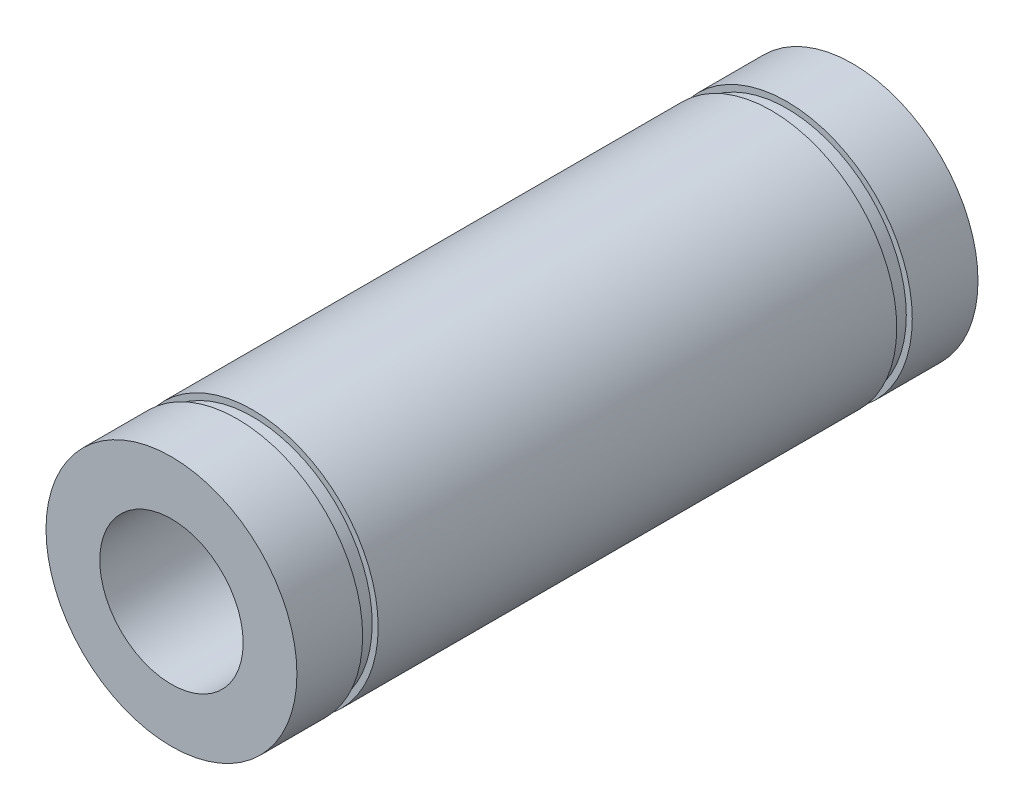
ISO-10303-21;
HEADER;
FILE_DESCRIPTION(('STEP AP214'),'2;1');
FILE_NAME('part.step','',(''),(''),'','','');
FILE_SCHEMA(('AUTOMOTIVE_DESIGN { 1 0 10303 214 1 1 1 1 }'));
ENDSEC;
DATA;
#1=APPLICATION_CONTEXT('core data for automotive mechanical design processes');
#2=APPLICATION_PROTOCOL_DEFINITION('international standard','automotive_design',2000,#1);
#3=PRODUCT_CONTEXT('',#1,'mechanical');
#4=PRODUCT('Part','Part','',(#3));
#5=PRODUCT_RELATED_PRODUCT_CATEGORY('part','',(#4));
#6=PRODUCT_DEFINITION_FORMATION('','',#4);
#7=PRODUCT_DEFINITION_CONTEXT('part definition',#1,'design');
#8=PRODUCT_DEFINITION('design','',#6,#7);
#9=PRODUCT_DEFINITION_SHAPE('','',#8);
#10=(LENGTH_UNIT() NAMED_UNIT(*) SI_UNIT(.MILLI.,.METRE.));
#11=(NAMED_UNIT(*) PLANE_ANGLE_UNIT() SI_UNIT($,.RADIAN.));
#12=(NAMED_UNIT(*) SI_UNIT($,.STERADIAN.) SOLID_ANGLE_UNIT());
#13=UNCERTAINTY_MEASURE_WITH_UNIT(LENGTH_MEASURE(1.E-05),#10,'distance_accuracy_value','');
#14=(GEOMETRIC_REPRESENTATION_CONTEXT(3) GLOBAL_UNCERTAINTY_ASSIGNED_CONTEXT((#13)) GLOBAL_UNIT_ASSIGNED_CONTEXT((#10,
#11,#12)) REPRESENTATION_CONTEXT('',''));
#15=CARTESIAN_POINT('',(0.,0.,0.));
#16=DIRECTION('',(0.,0.,1.));
#17=DIRECTION('',(1.,0.,0.));
#18=AXIS2_PLACEMENT_3D('',#15,#16,#17);
#19=CARTESIAN_POINT('',(0.,0.,0.));
#20=DIRECTION('',(0.,0.,1.));
#21=DIRECTION('',(1.,0.,0.));
#22=AXIS2_PLACEMENT_3D('',#19,#20,#21);
#23=CYLINDRICAL_SURFACE('',#22,10.5);
#24=CARTESIAN_POINT('',(0.,0.,-22.));
#25=DIRECTION('',(0.,0.,1.));
#26=DIRECTION('',(1.,0.,0.));
#27=AXIS2_PLACEMENT_3D('',#24,#25,#26);
#28=CIRCLE('',#27,10.5);
#29=CARTESIAN_POINT('',(10.5,0.,-22.));
#30=VERTEX_POINT('',#29);
#31=EDGE_CURVE('E10',#30,#30,#28,.T.);
#32=ORIENTED_EDGE('',*,*,#31,.T.);
#33=EDGE_LOOP('',(#32));
#34=FACE_BOUND('',#33,.T.);
#35=CARTESIAN_POINT('',(0.,0.,-16.5));
#36=DIRECTION('',(0.,0.,1.));
#37=DIRECTION('',(1.,0.,0.));
#38=AXIS2_PLACEMENT_3D('',#35,#36,#37);
#39=CIRCLE('',#38,10.5);
#40=CARTESIAN_POINT('',(10.5,0.,-16.5));
#41=VERTEX_POINT('',#40);
#42=EDGE_CURVE('E72',#41,#41,#39,.T.);
#43=ORIENTED_EDGE('',*,*,#42,.F.);
#44=EDGE_LOOP('',(#43));
#45=FACE_BOUND('',#44,.T.);
#46=ADVANCED_FACE('F32',(#34,#45),#23,.T.);
#47=CARTESIAN_POINT('',(10.5,0.,-22.));
#48=DIRECTION('',(0.,0.,-1.));
#49=DIRECTION('',(-1.,0.,0.));
#50=AXIS2_PLACEMENT_3D('',#47,#48,#49);
#51=PLANE('',#50);
#52=CARTESIAN_POINT('',(0.,0.,-22.));
#53=DIRECTION('',(0.,0.,1.));
#54=DIRECTION('',(1.,0.,0.));
#55=AXIS2_PLACEMENT_3D('',#52,#53,#54);
#56=CIRCLE('',#55,6.);
#57=CARTESIAN_POINT('',(6.,0.,-22.));
#58=VERTEX_POINT('',#57);
#59=EDGE_CURVE('E38',#58,#58,#56,.T.);
#60=ORIENTED_EDGE('',*,*,#59,.T.);
#61=EDGE_LOOP('',(#60));
#62=FACE_BOUND('',#61,.T.);
#63=ORIENTED_EDGE('',*,*,#31,.F.);
#64=EDGE_LOOP('',(#63));
#65=FACE_BOUND('',#64,.T.);
#66=ADVANCED_FACE('F80',(#62,#65),#51,.T.);
#67=CARTESIAN_POINT('',(0.,0.,0.));
#68=DIRECTION('',(0.,0.,1.));
#69=DIRECTION('',(1.,0.,0.));
#70=AXIS2_PLACEMENT_3D('',#67,#68,#69);
#71=CYLINDRICAL_SURFACE('',#70,6.);
#72=CARTESIAN_POINT('',(0.,0.,35.));
#73=DIRECTION('',(0.,0.,1.));
#74=DIRECTION('',(1.,0.,0.));
#75=AXIS2_PLACEMENT_3D('',#72,#73,#74);
#76=CIRCLE('',#75,6.00000000000001);
#77=CARTESIAN_POINT('',(6.00000000000001,0.,35.));
#78=VERTEX_POINT('',#77);
#79=EDGE_CURVE('E42',#78,#78,#76,.T.);
#80=ORIENTED_EDGE('',*,*,#79,.T.);
#81=EDGE_LOOP('',(#80));
#82=FACE_BOUND('',#81,.T.);
#83=ORIENTED_EDGE('',*,*,#59,.F.);
#84=EDGE_LOOP('',(#83));
#85=FACE_BOUND('',#84,.T.);
#86=ADVANCED_FACE('F84',(#82,#85),#71,.F.);
#87=CARTESIAN_POINT('',(6.00000000000001,0.,35.));
#88=DIRECTION('',(0.,0.,1.));
#89=DIRECTION('',(1.,0.,0.));
#90=AXIS2_PLACEMENT_3D('',#87,#88,#89);
#91=PLANE('',#90);
#92=CARTESIAN_POINT('',(0.,0.,35.));
#93=DIRECTION('',(0.,0.,1.));
#94=DIRECTION('',(1.,0.,0.));
#95=AXIS2_PLACEMENT_3D('',#92,#93,#94);
#96=CIRCLE('',#95,10.5);
#97=CARTESIAN_POINT('',(10.5,0.,35.));
#98=VERTEX_POINT('',#97);
#99=EDGE_CURVE('E46',#98,#98,#96,.T.);
#100=ORIENTED_EDGE('',*,*,#99,.T.);
#101=EDGE_LOOP('',(#100));
#102=FACE_BOUND('',#101,.T.);
#103=ORIENTED_EDGE('',*,*,#79,.F.);
#104=EDGE_LOOP('',(#103));
#105=FACE_BOUND('',#104,.T.);
#106=ADVANCED_FACE('F88',(#102,#105),#91,.T.);
#107=CARTESIAN_POINT('',(0.,0.,0.));
#108=DIRECTION('',(0.,0.,1.));
#109=DIRECTION('',(1.,0.,0.));
#110=AXIS2_PLACEMENT_3D('',#107,#108,#109);
#111=CYLINDRICAL_SURFACE('',#110,10.5);
#112=CARTESIAN_POINT('',(0.,0.,29.5));
#113=DIRECTION('',(0.,0.,1.));
#114=DIRECTION('',(1.,0.,0.));
#115=AXIS2_PLACEMENT_3D('',#112,#113,#114);
#116=CIRCLE('',#115,10.5);
#117=CARTESIAN_POINT('',(10.5,0.,29.5));
#118=VERTEX_POINT('',#117);
#119=EDGE_CURVE('E51',#118,#118,#116,.T.);
#120=ORIENTED_EDGE('',*,*,#119,.T.);
#121=EDGE_LOOP('',(#120));
#122=FACE_BOUND('',#121,.T.);
#123=ORIENTED_EDGE('',*,*,#99,.F.);
#124=EDGE_LOOP('',(#123));
#125=FACE_BOUND('',#124,.T.);
#126=ADVANCED_FACE('F95',(#122,#125),#111,.T.);
#127=CARTESIAN_POINT('',(10.5,0.,29.5));
#128=DIRECTION('',(0.,0.,-1.));
#129=DIRECTION('',(-1.,0.,0.));
#130=AXIS2_PLACEMENT_3D('',#127,#128,#129);
#131=PLANE('',#130);
#132=CARTESIAN_POINT('',(0.,0.,29.5));
#133=DIRECTION('',(0.,0.,1.));
#134=DIRECTION('',(1.,0.,0.));
#135=AXIS2_PLACEMENT_3D('',#132,#133,#134);
#136=CIRCLE('',#135,10.);
#137=CARTESIAN_POINT('',(10.,0.,29.5));
#138=VERTEX_POINT('',#137);
#139=EDGE_CURVE('E54',#138,#138,#136,.T.);
#140=ORIENTED_EDGE('',*,*,#139,.T.);
#141=EDGE_LOOP('',(#140));
#142=FACE_BOUND('',#141,.T.);
#143=ORIENTED_EDGE('',*,*,#119,.F.);
#144=EDGE_LOOP('',(#143));
#145=FACE_BOUND('',#144,.T.);
#146=ADVANCED_FACE('F99',(#142,#145),#131,.T.);
#147=CARTESIAN_POINT('',(0.,0.,0.));
#148=DIRECTION('',(0.,0.,1.));
#149=DIRECTION('',(1.,0.,0.));
#150=AXIS2_PLACEMENT_3D('',#147,#148,#149);
#151=CYLINDRICAL_SURFACE('',#150,10.);
#152=CARTESIAN_POINT('',(0.,0.,28.2));
#153=DIRECTION('',(0.,0.,1.));
#154=DIRECTION('',(1.,0.,0.));
#155=AXIS2_PLACEMENT_3D('',#152,#153,#154);
#156=CIRCLE('',#155,10.);
#157=CARTESIAN_POINT('',(10.,0.,28.2));
#158=VERTEX_POINT('',#157);
#159=EDGE_CURVE('E57',#158,#158,#156,.T.);
#160=ORIENTED_EDGE('',*,*,#159,.T.);
#161=EDGE_LOOP('',(#160));
#162=FACE_BOUND('',#161,.T.);
#163=ORIENTED_EDGE('',*,*,#139,.F.);
#164=EDGE_LOOP('',(#163));
#165=FACE_BOUND('',#164,.T.);
#166=ADVANCED_FACE('F103',(#162,#165),#151,.T.);
#167=CARTESIAN_POINT('',(10.,0.,28.2));
#168=DIRECTION('',(0.,0.,1.));
#169=DIRECTION('',(1.,0.,0.));
#170=AXIS2_PLACEMENT_3D('',#167,#168,#169);
#171=PLANE('',#170);
#172=CARTESIAN_POINT('',(0.,0.,28.2));
#173=DIRECTION('',(0.,0.,1.));
#174=DIRECTION('',(1.,0.,0.));
#175=AXIS2_PLACEMENT_3D('',#172,#173,#174);
#176=CIRCLE('',#175,10.5);
#177=CARTESIAN_POINT('',(10.5,0.,28.2));
#178=VERTEX_POINT('',#177);
#179=EDGE_CURVE('E60',#178,#178,#176,.T.);
#180=ORIENTED_EDGE('',*,*,#179,.T.);
#181=EDGE_LOOP('',(#180));
#182=FACE_BOUND('',#181,.T.);
#183=ORIENTED_EDGE('',*,*,#159,.F.);
#184=EDGE_LOOP('',(#183));
#185=FACE_BOUND('',#184,.T.);
#186=ADVANCED_FACE('F107',(#182,#185),#171,.T.);
#187=CARTESIAN_POINT('',(0.,0.,0.));
#188=DIRECTION('',(0.,0.,1.));
#189=DIRECTION('',(1.,0.,0.));
#190=AXIS2_PLACEMENT_3D('',#187,#188,#189);
#191=CYLINDRICAL_SURFACE('',#190,10.5);
#192=CARTESIAN_POINT('',(0.,0.,-15.2));
#193=DIRECTION('',(0.,0.,1.));
#194=DIRECTION('',(1.,0.,0.));
#195=AXIS2_PLACEMENT_3D('',#192,#193,#194);
#196=CIRCLE('',#195,10.5);
#197=CARTESIAN_POINT('',(10.5,0.,-15.2));
#198=VERTEX_POINT('',#197);
#199=EDGE_CURVE('E63',#198,#198,#196,.T.);
#200=ORIENTED_EDGE('',*,*,#199,.T.);
#201=EDGE_LOOP('',(#200));
#202=FACE_BOUND('',#201,.T.);
#203=ORIENTED_EDGE('',*,*,#179,.F.);
#204=EDGE_LOOP('',(#203));
#205=FACE_BOUND('',#204,.T.);
#206=ADVANCED_FACE('F111',(#202,#205),#191,.T.);
#207=CARTESIAN_POINT('',(10.5,0.,-15.2));
#208=DIRECTION('',(0.,0.,-1.));
#209=DIRECTION('',(-1.,0.,0.));
#210=AXIS2_PLACEMENT_3D('',#207,#208,#209);
#211=PLANE('',#210);
#212=CARTESIAN_POINT('',(0.,0.,-15.2));
#213=DIRECTION('',(0.,0.,1.));
#214=DIRECTION('',(1.,0.,0.));
#215=AXIS2_PLACEMENT_3D('',#212,#213,#214);
#216=CIRCLE('',#215,10.);
#217=CARTESIAN_POINT('',(10.,0.,-15.2));
#218=VERTEX_POINT('',#217);
#219=EDGE_CURVE('E66',#218,#218,#216,.T.);
#220=ORIENTED_EDGE('',*,*,#219,.T.);
#221=EDGE_LOOP('',(#220));
#222=FACE_BOUND('',#221,.T.);
#223=ORIENTED_EDGE('',*,*,#199,.F.);
#224=EDGE_LOOP('',(#223));
#225=FACE_BOUND('',#224,.T.);
#226=ADVANCED_FACE('F115',(#222,#225),#211,.T.);
#227=CARTESIAN_POINT('',(0.,0.,0.));
#228=DIRECTION('',(0.,0.,1.));
#229=DIRECTION('',(1.,0.,0.));
#230=AXIS2_PLACEMENT_3D('',#227,#228,#229);
#231=CYLINDRICAL_SURFACE('',#230,10.);
#232=CARTESIAN_POINT('',(0.,0.,-16.5));
#233=DIRECTION('',(0.,0.,1.));
#234=DIRECTION('',(1.,0.,0.));
#235=AXIS2_PLACEMENT_3D('',#232,#233,#234);
#236=CIRCLE('',#235,10.);
#237=CARTESIAN_POINT('',(10.,0.,-16.5));
#238=VERTEX_POINT('',#237);
#239=EDGE_CURVE('E69',#238,#238,#236,.T.);
#240=ORIENTED_EDGE('',*,*,#239,.T.);
#241=EDGE_LOOP('',(#240));
#242=FACE_BOUND('',#241,.T.);
#243=ORIENTED_EDGE('',*,*,#219,.F.);
#244=EDGE_LOOP('',(#243));
#245=FACE_BOUND('',#244,.T.);
#246=ADVANCED_FACE('F119',(#242,#245),#231,.T.);
#247=CARTESIAN_POINT('',(10.,0.,-16.5));
#248=DIRECTION('',(0.,0.,1.));
#249=DIRECTION('',(1.,0.,0.));
#250=AXIS2_PLACEMENT_3D('',#247,#248,#249);
#251=PLANE('',#250);
#252=ORIENTED_EDGE('',*,*,#42,.T.);
#253=EDGE_LOOP('',(#252));
#254=FACE_BOUND('',#253,.T.);
#255=ORIENTED_EDGE('',*,*,#239,.F.);
#256=EDGE_LOOP('',(#255));
#257=FACE_BOUND('',#256,.T.);
#258=ADVANCED_FACE('F76',(#254,#257),#251,.T.);
#259=CLOSED_SHELL('',(#46,#66,#86,#106,#126,#146,#166,#186,#206,#226,#246,#258));
#260=MANIFOLD_SOLID_BREP('B2',#259);
#261=ADVANCED_BREP_SHAPE_REPRESENTATION('',(#18,#260),#14);
#262=SHAPE_DEFINITION_REPRESENTATION(#9,#261);
ENDSEC;
END-ISO-10303-21;
